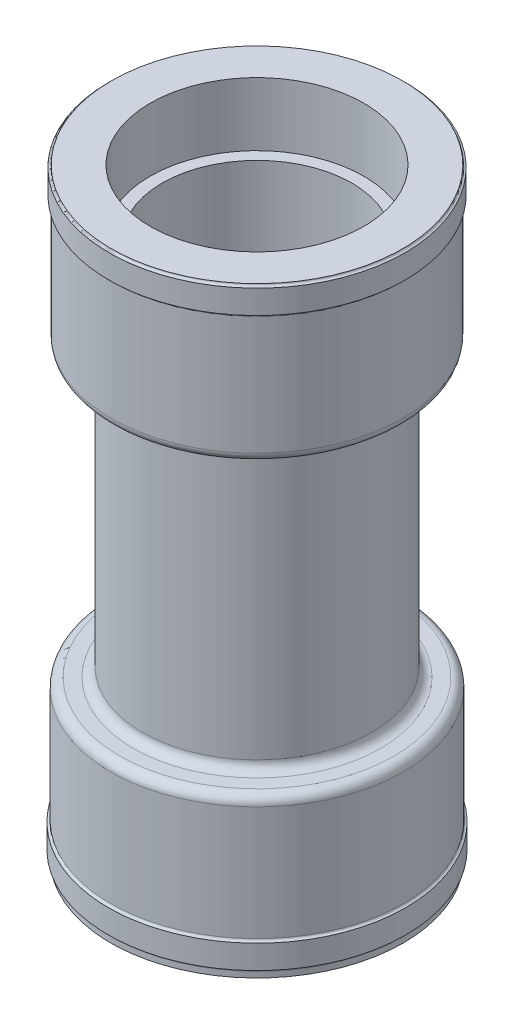
ISO-10303-21;
HEADER;
FILE_DESCRIPTION(('STEP AP214'),'2;1');
FILE_NAME('part.step','',(''),(''),'','','');
FILE_SCHEMA(('AUTOMOTIVE_DESIGN { 1 0 10303 214 1 1 1 1 }'));
ENDSEC;
DATA;
#1=APPLICATION_CONTEXT('core data for automotive mechanical design processes');
#2=APPLICATION_PROTOCOL_DEFINITION('international standard','automotive_design',2000,#1);
#3=PRODUCT_CONTEXT('',#1,'mechanical');
#4=PRODUCT('Part','Part','',(#3));
#5=PRODUCT_RELATED_PRODUCT_CATEGORY('part','',(#4));
#6=PRODUCT_DEFINITION_FORMATION('','',#4);
#7=PRODUCT_DEFINITION_CONTEXT('part definition',#1,'design');
#8=PRODUCT_DEFINITION('design','',#6,#7);
#9=PRODUCT_DEFINITION_SHAPE('','',#8);
#10=(LENGTH_UNIT() NAMED_UNIT(*) SI_UNIT(.MILLI.,.METRE.));
#11=(NAMED_UNIT(*) PLANE_ANGLE_UNIT() SI_UNIT($,.RADIAN.));
#12=(NAMED_UNIT(*) SI_UNIT($,.STERADIAN.) SOLID_ANGLE_UNIT());
#13=UNCERTAINTY_MEASURE_WITH_UNIT(LENGTH_MEASURE(1.E-05),#10,'distance_accuracy_value','');
#14=(GEOMETRIC_REPRESENTATION_CONTEXT(3) GLOBAL_UNCERTAINTY_ASSIGNED_CONTEXT((#13)) GLOBAL_UNIT_ASSIGNED_CONTEXT((#10,
#11,#12)) REPRESENTATION_CONTEXT('',''));
#15=CARTESIAN_POINT('',(0.,0.,0.));
#16=DIRECTION('',(0.,0.,1.));
#17=DIRECTION('',(1.,0.,0.));
#18=AXIS2_PLACEMENT_3D('',#15,#16,#17);
#19=CARTESIAN_POINT('',(0.,-105.537304087526,0.));
#20=DIRECTION('',(0.,-1.,0.));
#21=DIRECTION('',(1.,0.,0.));
#22=AXIS2_PLACEMENT_3D('',#19,#20,#21);
#23=PLANE('',#22);
#24=CARTESIAN_POINT('',(-61.3139252065648,-105.537304087526,0.));
#25=DIRECTION('',(0.,-1.,0.));
#26=DIRECTION('',(1.,0.,0.));
#27=AXIS2_PLACEMENT_3D('',#24,#25,#26);
#28=CIRCLE('',#27,54.);
#29=CARTESIAN_POINT('',(-7.31392520656485,-105.537304087526,0.));
#30=VERTEX_POINT('',#29);
#31=EDGE_CURVE('E62',#30,#30,#28,.T.);
#32=ORIENTED_EDGE('',*,*,#31,.T.);
#33=EDGE_LOOP('',(#32));
#34=FACE_BOUND('',#33,.T.);
#35=CARTESIAN_POINT('',(-61.3139252065648,-105.537304087526,0.));
#36=DIRECTION('',(0.,-1.,0.));
#37=DIRECTION('',(1.,0.,0.));
#38=AXIS2_PLACEMENT_3D('',#35,#36,#37);
#39=CIRCLE('',#38,59.8154522615405);
#40=CARTESIAN_POINT('',(-1.4984729450243,-105.537304087526,0.));
#41=VERTEX_POINT('',#40);
#42=EDGE_CURVE('E66',#41,#41,#39,.F.);
#43=ORIENTED_EDGE('',*,*,#42,.T.);
#44=EDGE_LOOP('',(#43));
#45=FACE_BOUND('',#44,.T.);
#46=ADVANCED_FACE('F38',(#34,#45),#23,.F.);
#47=CARTESIAN_POINT('',(-61.3139252065649,87.9722338350284,0.));
#48=DIRECTION('',(0.,1.,0.));
#49=DIRECTION('',(-1.,0.,0.));
#50=AXIS2_PLACEMENT_3D('',#47,#48,#49);
#51=CYLINDRICAL_SURFACE('',#50,50.);
#52=CARTESIAN_POINT('',(-61.3139252065648,-101.537304087526,0.));
#53=DIRECTION('',(0.,-1.,0.));
#54=DIRECTION('',(1.,0.,0.));
#55=AXIS2_PLACEMENT_3D('',#52,#53,#54);
#56=CIRCLE('',#55,50.);
#57=CARTESIAN_POINT('',(-11.3139252065649,-101.537304087526,0.));
#58=VERTEX_POINT('',#57);
#59=EDGE_CURVE('E70',#58,#58,#56,.F.);
#60=ORIENTED_EDGE('',*,*,#59,.T.);
#61=EDGE_LOOP('',(#60));
#62=FACE_BOUND('',#61,.T.);
#63=CARTESIAN_POINT('',(-61.3139252065648,15.8953921677388,0.));
#64=DIRECTION('',(0.,-1.,0.));
#65=DIRECTION('',(1.,0.,0.));
#66=AXIS2_PLACEMENT_3D('',#63,#64,#65);
#67=CIRCLE('',#66,50.);
#68=CARTESIAN_POINT('',(-11.3139252065649,15.8953921677388,0.));
#69=VERTEX_POINT('',#68);
#70=EDGE_CURVE('E74',#69,#69,#67,.T.);
#71=ORIENTED_EDGE('',*,*,#70,.T.);
#72=EDGE_LOOP('',(#71));
#73=FACE_BOUND('',#72,.T.);
#74=ADVANCED_FACE('F178',(#62,#73),#51,.T.);
#75=CARTESIAN_POINT('',(0.,19.8953921677388,0.));
#76=DIRECTION('',(0.,-1.,0.));
#77=DIRECTION('',(1.,0.,0.));
#78=AXIS2_PLACEMENT_3D('',#75,#76,#77);
#79=PLANE('',#78);
#80=CARTESIAN_POINT('',(-61.3139252065648,19.8953921677388,0.));
#81=DIRECTION('',(0.,-1.,0.));
#82=DIRECTION('',(1.,0.,0.));
#83=AXIS2_PLACEMENT_3D('',#80,#81,#82);
#84=CIRCLE('',#83,54.);
#85=CARTESIAN_POINT('',(-7.31392520656487,19.8953921677388,0.));
#86=VERTEX_POINT('',#85);
#87=EDGE_CURVE('E46',#86,#86,#84,.F.);
#88=ORIENTED_EDGE('',*,*,#87,.T.);
#89=EDGE_LOOP('',(#88));
#90=FACE_BOUND('',#89,.T.);
#91=CARTESIAN_POINT('',(-61.3139252065648,19.8953921677388,0.));
#92=DIRECTION('',(0.,-1.,0.));
#93=DIRECTION('',(1.,0.,0.));
#94=AXIS2_PLACEMENT_3D('',#91,#92,#93);
#95=CIRCLE('',#94,59.5246096301648);
#96=CARTESIAN_POINT('',(-1.78931557640005,19.8953921677388,0.));
#97=VERTEX_POINT('',#96);
#98=EDGE_CURVE('E51',#97,#97,#95,.T.);
#99=ORIENTED_EDGE('',*,*,#98,.T.);
#100=EDGE_LOOP('',(#99));
#101=FACE_BOUND('',#100,.T.);
#102=ADVANCED_FACE('F184',(#90,#101),#79,.T.);
#103=CARTESIAN_POINT('',(-61.3139252065649,87.9722338350284,0.));
#104=DIRECTION('',(0.,1.,0.));
#105=DIRECTION('',(-1.,0.,0.));
#106=AXIS2_PLACEMENT_3D('',#103,#104,#105);
#107=CYLINDRICAL_SURFACE('',#106,63.5246096301648);
#108=CARTESIAN_POINT('',(-61.3139252065648,23.8953921677388,0.));
#109=DIRECTION('',(0.,-1.,0.));
#110=DIRECTION('',(1.,0.,0.));
#111=AXIS2_PLACEMENT_3D('',#108,#109,#110);
#112=CIRCLE('',#111,63.5246096301648);
#113=CARTESIAN_POINT('',(2.21068442359996,23.8953921677388,0.));
#114=VERTEX_POINT('',#113);
#115=EDGE_CURVE('E10',#114,#114,#112,.F.);
#116=ORIENTED_EDGE('',*,*,#115,.T.);
#117=EDGE_LOOP('',(#116));
#118=FACE_BOUND('',#117,.T.);
#119=CARTESIAN_POINT('',(-61.3139252065649,75.6285317828332,0.));
#120=DIRECTION('',(0.,-1.,0.));
#121=DIRECTION('',(1.,0.,0.));
#122=AXIS2_PLACEMENT_3D('',#119,#120,#121);
#123=CIRCLE('',#122,63.5246096301648);
#124=CARTESIAN_POINT('',(2.21068442359995,75.6285317828332,0.));
#125=VERTEX_POINT('',#124);
#126=EDGE_CURVE('E82',#125,#125,#123,.T.);
#127=ORIENTED_EDGE('',*,*,#126,.T.);
#128=EDGE_LOOP('',(#127));
#129=FACE_BOUND('',#128,.T.);
#130=ADVANCED_FACE('F191',(#118,#129),#107,.T.);
#131=CARTESIAN_POINT('',(0.,76.6285317828332,0.));
#132=DIRECTION('',(0.,-1.,0.));
#133=DIRECTION('',(1.,0.,0.));
#134=AXIS2_PLACEMENT_3D('',#131,#132,#133);
#135=PLANE('',#134);
#136=CARTESIAN_POINT('',(-61.3139252065649,76.6285317828332,0.));
#137=DIRECTION('',(0.,-1.,0.));
#138=DIRECTION('',(1.,0.,0.));
#139=AXIS2_PLACEMENT_3D('',#136,#137,#138);
#140=CIRCLE('',#139,64.5246096301648);
#141=CARTESIAN_POINT('',(3.21068442359995,76.6285317828332,0.));
#142=VERTEX_POINT('',#141);
#143=EDGE_CURVE('E86',#142,#142,#140,.F.);
#144=ORIENTED_EDGE('',*,*,#143,.T.);
#145=EDGE_LOOP('',(#144));
#146=FACE_BOUND('',#145,.T.);
#147=CARTESIAN_POINT('',(-61.3139252065649,76.6285317828332,0.));
#148=DIRECTION('',(0.,1.,0.));
#149=DIRECTION('',(-1.,0.,0.));
#150=AXIS2_PLACEMENT_3D('',#147,#148,#149);
#151=CIRCLE('',#150,64.5287115122409);
#152=CARTESIAN_POINT('',(-125.842636718806,76.6285317828332,0.));
#153=VERTEX_POINT('',#152);
#154=EDGE_CURVE('E102',#153,#153,#151,.T.);
#155=ORIENTED_EDGE('',*,*,#154,.F.);
#156=EDGE_LOOP('',(#155));
#157=FACE_BOUND('',#156,.T.);
#158=ADVANCED_FACE('F194',(#146,#157),#135,.T.);
#159=CARTESIAN_POINT('',(-61.3139252065649,87.9722338350284,0.));
#160=DIRECTION('',(0.,1.,0.));
#161=DIRECTION('',(-1.,0.,0.));
#162=AXIS2_PLACEMENT_3D('',#159,#160,#161);
#163=CYLINDRICAL_SURFACE('',#162,64.5287115122409);
#164=ORIENTED_EDGE('',*,*,#154,.T.);
#165=EDGE_LOOP('',(#164));
#166=FACE_BOUND('',#165,.T.);
#167=CARTESIAN_POINT('',(-61.3139252065649,86.9722338350284,0.));
#168=DIRECTION('',(0.,1.,0.));
#169=DIRECTION('',(-1.,0.,0.));
#170=AXIS2_PLACEMENT_3D('',#167,#168,#169);
#171=CIRCLE('',#170,64.5287115122409);
#172=CARTESIAN_POINT('',(-125.842636718806,86.9722338350284,0.));
#173=VERTEX_POINT('',#172);
#174=EDGE_CURVE('E106',#173,#173,#171,.T.);
#175=ORIENTED_EDGE('',*,*,#174,.F.);
#176=EDGE_LOOP('',(#175));
#177=FACE_BOUND('',#176,.T.);
#178=ADVANCED_FACE('F197',(#166,#177),#163,.T.);
#179=CARTESIAN_POINT('',(0.,86.9722338350284,0.));
#180=DIRECTION('',(0.,1.,0.));
#181=DIRECTION('',(-1.,0.,0.));
#182=AXIS2_PLACEMENT_3D('',#179,#180,#181);
#183=PLANE('',#182);
#184=CARTESIAN_POINT('',(-61.3139252065649,86.9722338350284,0.));
#185=DIRECTION('',(0.,1.,0.));
#186=DIRECTION('',(-1.,0.,0.));
#187=AXIS2_PLACEMENT_3D('',#184,#185,#186);
#188=CIRCLE('',#187,64.5085184717571);
#189=CARTESIAN_POINT('',(-125.822443678322,86.9722338350284,0.));
#190=VERTEX_POINT('',#189);
#191=EDGE_CURVE('E78',#190,#190,#188,.F.);
#192=ORIENTED_EDGE('',*,*,#191,.T.);
#193=EDGE_LOOP('',(#192));
#194=FACE_BOUND('',#193,.T.);
#195=ORIENTED_EDGE('',*,*,#174,.T.);
#196=EDGE_LOOP('',(#195));
#197=FACE_BOUND('',#196,.T.);
#198=ADVANCED_FACE('F201',(#194,#197),#183,.T.);
#199=CARTESIAN_POINT('',(0.,87.9722338350284,0.));
#200=DIRECTION('',(0.,1.,0.));
#201=DIRECTION('',(-1.,0.,0.));
#202=AXIS2_PLACEMENT_3D('',#199,#200,#201);
#203=PLANE('',#202);
#204=CARTESIAN_POINT('',(-61.3139252065649,87.9722338350284,0.));
#205=DIRECTION('',(0.,1.,0.));
#206=DIRECTION('',(-1.,0.,0.));
#207=AXIS2_PLACEMENT_3D('',#204,#205,#206);
#208=CIRCLE('',#207,63.5085184717571);
#209=CARTESIAN_POINT('',(-124.822443678322,87.9722338350284,0.));
#210=VERTEX_POINT('',#209);
#211=EDGE_CURVE('E110',#210,#210,#208,.T.);
#212=ORIENTED_EDGE('',*,*,#211,.T.);
#213=EDGE_LOOP('',(#212));
#214=FACE_BOUND('',#213,.T.);
#215=CARTESIAN_POINT('',(-61.3139252065649,87.9722338350284,0.));
#216=DIRECTION('',(0.,1.,0.));
#217=DIRECTION('',(-1.,0.,0.));
#218=AXIS2_PLACEMENT_3D('',#215,#216,#217);
#219=CIRCLE('',#218,46.6);
#220=CARTESIAN_POINT('',(-107.913925206565,87.9722338350284,0.));
#221=VERTEX_POINT('',#220);
#222=EDGE_CURVE('E114',#221,#221,#219,.T.);
#223=ORIENTED_EDGE('',*,*,#222,.F.);
#224=EDGE_LOOP('',(#223));
#225=FACE_BOUND('',#224,.T.);
#226=ADVANCED_FACE('F205',(#214,#225),#203,.T.);
#227=CARTESIAN_POINT('',(-61.3139252065649,87.9722338350284,0.));
#228=DIRECTION('',(0.,1.,0.));
#229=DIRECTION('',(-1.,0.,0.));
#230=AXIS2_PLACEMENT_3D('',#227,#228,#229);
#231=CYLINDRICAL_SURFACE('',#230,46.6);
#232=ORIENTED_EDGE('',*,*,#222,.T.);
#233=EDGE_LOOP('',(#232));
#234=FACE_BOUND('',#233,.T.);
#235=CARTESIAN_POINT('',(-61.3139252065649,60.3722338350283,0.));
#236=DIRECTION('',(0.,1.,0.));
#237=DIRECTION('',(-1.,0.,0.));
#238=AXIS2_PLACEMENT_3D('',#235,#236,#237);
#239=CIRCLE('',#238,46.6);
#240=CARTESIAN_POINT('',(-107.913925206565,60.3722338350283,0.));
#241=VERTEX_POINT('',#240);
#242=EDGE_CURVE('E118',#241,#241,#239,.T.);
#243=ORIENTED_EDGE('',*,*,#242,.F.);
#244=EDGE_LOOP('',(#243));
#245=FACE_BOUND('',#244,.T.);
#246=ADVANCED_FACE('F209',(#234,#245),#231,.F.);
#247=CARTESIAN_POINT('',(0.,60.3722338350284,0.));
#248=DIRECTION('',(0.,1.,0.));
#249=DIRECTION('',(-1.,0.,0.));
#250=AXIS2_PLACEMENT_3D('',#247,#248,#249);
#251=PLANE('',#250);
#252=ORIENTED_EDGE('',*,*,#242,.T.);
#253=EDGE_LOOP('',(#252));
#254=FACE_BOUND('',#253,.T.);
#255=CARTESIAN_POINT('',(-61.3139252065649,60.3722338350283,0.));
#256=DIRECTION('',(0.,1.,0.));
#257=DIRECTION('',(-1.,0.,0.));
#258=AXIS2_PLACEMENT_3D('',#255,#256,#257);
#259=CIRCLE('',#258,41.4);
#260=CARTESIAN_POINT('',(-102.713925206565,60.3722338350283,0.));
#261=VERTEX_POINT('',#260);
#262=EDGE_CURVE('E122',#261,#261,#259,.T.);
#263=ORIENTED_EDGE('',*,*,#262,.F.);
#264=EDGE_LOOP('',(#263));
#265=FACE_BOUND('',#264,.T.);
#266=ADVANCED_FACE('F213',(#254,#265),#251,.T.);
#267=CARTESIAN_POINT('',(-61.3139252065649,87.9722338350284,0.));
#268=DIRECTION('',(0.,1.,0.));
#269=DIRECTION('',(-1.,0.,0.));
#270=AXIS2_PLACEMENT_3D('',#267,#268,#269);
#271=CYLINDRICAL_SURFACE('',#270,41.4);
#272=ORIENTED_EDGE('',*,*,#262,.T.);
#273=EDGE_LOOP('',(#272));
#274=FACE_BOUND('',#273,.T.);
#275=CARTESIAN_POINT('',(-61.3139252065648,-139.6277717328,0.));
#276=DIRECTION('',(0.,1.,0.));
#277=DIRECTION('',(-1.,0.,0.));
#278=AXIS2_PLACEMENT_3D('',#275,#276,#277);
#279=CIRCLE('',#278,41.4);
#280=CARTESIAN_POINT('',(-102.713925206565,-139.6277717328,0.));
#281=VERTEX_POINT('',#280);
#282=EDGE_CURVE('E126',#281,#281,#279,.T.);
#283=ORIENTED_EDGE('',*,*,#282,.F.);
#284=EDGE_LOOP('',(#283));
#285=FACE_BOUND('',#284,.T.);
#286=ADVANCED_FACE('F217',(#274,#285),#271,.F.);
#287=CARTESIAN_POINT('',(0.,-139.6277717328,0.));
#288=DIRECTION('',(0.,1.,0.));
#289=DIRECTION('',(-1.,0.,0.));
#290=AXIS2_PLACEMENT_3D('',#287,#288,#289);
#291=PLANE('',#290);
#292=CARTESIAN_POINT('',(-61.3139252065648,-139.6277717328,0.));
#293=DIRECTION('',(0.,1.,0.));
#294=DIRECTION('',(-1.,0.,0.));
#295=AXIS2_PLACEMENT_3D('',#292,#293,#294);
#296=CIRCLE('',#295,46.5971743800978);
#297=CARTESIAN_POINT('',(-107.911099586663,-139.6277717328,0.));
#298=VERTEX_POINT('',#297);
#299=EDGE_CURVE('E130',#298,#298,#296,.T.);
#300=ORIENTED_EDGE('',*,*,#299,.F.);
#301=EDGE_LOOP('',(#300));
#302=FACE_BOUND('',#301,.T.);
#303=ORIENTED_EDGE('',*,*,#282,.T.);
#304=EDGE_LOOP('',(#303));
#305=FACE_BOUND('',#304,.T.);
#306=ADVANCED_FACE('F221',(#302,#305),#291,.F.);
#307=CARTESIAN_POINT('',(-61.3139252065649,87.9722338350284,0.));
#308=DIRECTION('',(0.,1.,0.));
#309=DIRECTION('',(-1.,0.,0.));
#310=AXIS2_PLACEMENT_3D('',#307,#308,#309);
#311=CYLINDRICAL_SURFACE('',#310,46.5971743800978);
#312=CARTESIAN_POINT('',(-61.3139252065648,-174.174326463567,0.));
#313=DIRECTION('',(0.,1.,0.));
#314=DIRECTION('',(-1.,0.,0.));
#315=AXIS2_PLACEMENT_3D('',#312,#313,#314);
#316=CIRCLE('',#315,46.5971743800978);
#317=CARTESIAN_POINT('',(-107.911099586663,-174.174326463567,0.));
#318=VERTEX_POINT('',#317);
#319=EDGE_CURVE('E134',#318,#318,#316,.T.);
#320=ORIENTED_EDGE('',*,*,#319,.F.);
#321=EDGE_LOOP('',(#320));
#322=FACE_BOUND('',#321,.T.);
#323=ORIENTED_EDGE('',*,*,#299,.T.);
#324=EDGE_LOOP('',(#323));
#325=FACE_BOUND('',#324,.T.);
#326=ADVANCED_FACE('F225',(#322,#325),#311,.F.);
#327=CARTESIAN_POINT('',(0.,-174.174326463567,0.));
#328=DIRECTION('',(0.,1.,0.));
#329=DIRECTION('',(-1.,0.,0.));
#330=AXIS2_PLACEMENT_3D('',#327,#328,#329);
#331=PLANE('',#330);
#332=CARTESIAN_POINT('',(-61.3139252065648,-174.174326463567,0.));
#333=DIRECTION('',(0.,1.,0.));
#334=DIRECTION('',(-1.,0.,0.));
#335=AXIS2_PLACEMENT_3D('',#332,#333,#334);
#336=CIRCLE('',#335,63.8241057894739);
#337=CARTESIAN_POINT('',(-125.138030996039,-174.174326463567,0.));
#338=VERTEX_POINT('',#337);
#339=EDGE_CURVE('E138',#338,#338,#336,.T.);
#340=ORIENTED_EDGE('',*,*,#339,.F.);
#341=EDGE_LOOP('',(#340));
#342=FACE_BOUND('',#341,.T.);
#343=ORIENTED_EDGE('',*,*,#319,.T.);
#344=EDGE_LOOP('',(#343));
#345=FACE_BOUND('',#344,.T.);
#346=ADVANCED_FACE('F229',(#342,#345),#331,.F.);
#347=CARTESIAN_POINT('',(-61.3139252065649,87.9722338350284,0.));
#348=DIRECTION('',(0.,1.,0.));
#349=DIRECTION('',(-1.,0.,0.));
#350=AXIS2_PLACEMENT_3D('',#347,#348,#349);
#351=CYLINDRICAL_SURFACE('',#350,63.8241057894739);
#352=CARTESIAN_POINT('',(-61.3139252065648,-171.671498813625,0.));
#353=DIRECTION('',(0.,1.,0.));
#354=DIRECTION('',(-1.,0.,0.));
#355=AXIS2_PLACEMENT_3D('',#352,#353,#354);
#356=CIRCLE('',#355,63.8241057894739);
#357=CARTESIAN_POINT('',(-125.138030996039,-171.671498813625,0.));
#358=VERTEX_POINT('',#357);
#359=EDGE_CURVE('E90',#358,#358,#356,.F.);
#360=ORIENTED_EDGE('',*,*,#359,.T.);
#361=EDGE_LOOP('',(#360));
#362=FACE_BOUND('',#361,.T.);
#363=ORIENTED_EDGE('',*,*,#339,.T.);
#364=EDGE_LOOP('',(#363));
#365=FACE_BOUND('',#364,.T.);
#366=ADVANCED_FACE('F156',(#362,#365),#351,.T.);
#367=CARTESIAN_POINT('',(-61.3139252065649,87.9722338350284,0.));
#368=DIRECTION('',(0.,1.,0.));
#369=DIRECTION('',(-1.,0.,0.));
#370=AXIS2_PLACEMENT_3D('',#367,#368,#369);
#371=CYLINDRICAL_SURFACE('',#370,64.8198825707748);
#372=CARTESIAN_POINT('',(-61.3139252065648,-160.321084419236,0.));
#373=DIRECTION('',(0.,1.,0.));
#374=DIRECTION('',(-1.,0.,0.));
#375=AXIS2_PLACEMENT_3D('',#372,#373,#374);
#376=CIRCLE('',#375,64.8198825707748);
#377=CARTESIAN_POINT('',(-126.13380777734,-160.321084419236,0.));
#378=VERTEX_POINT('',#377);
#379=EDGE_CURVE('E146',#378,#378,#376,.T.);
#380=ORIENTED_EDGE('',*,*,#379,.F.);
#381=EDGE_LOOP('',(#380));
#382=FACE_BOUND('',#381,.T.);
#383=CARTESIAN_POINT('',(-61.3139252065648,-170.671507731452,0.));
#384=DIRECTION('',(0.,1.,0.));
#385=DIRECTION('',(-1.,0.,0.));
#386=AXIS2_PLACEMENT_3D('',#383,#384,#385);
#387=CIRCLE('',#386,64.8198825707748);
#388=CARTESIAN_POINT('',(-126.13380777734,-170.671507731452,0.));
#389=VERTEX_POINT('',#388);
#390=EDGE_CURVE('E142',#389,#389,#387,.T.);
#391=ORIENTED_EDGE('',*,*,#390,.T.);
#392=EDGE_LOOP('',(#391));
#393=FACE_BOUND('',#392,.T.);
#394=ADVANCED_FACE('F153',(#382,#393),#371,.T.);
#395=CARTESIAN_POINT('',(0.,-160.321084419236,0.));
#396=DIRECTION('',(0.,-1.,0.));
#397=DIRECTION('',(1.,0.,0.));
#398=AXIS2_PLACEMENT_3D('',#395,#396,#397);
#399=PLANE('',#398);
#400=CARTESIAN_POINT('',(-61.3139252065648,-160.321084419236,0.));
#401=DIRECTION('',(0.,-1.,0.));
#402=DIRECTION('',(1.,0.,0.));
#403=AXIS2_PLACEMENT_3D('',#400,#401,#402);
#404=CIRCLE('',#403,64.8154522615405);
#405=CARTESIAN_POINT('',(3.50152705497571,-160.321084419236,0.));
#406=VERTEX_POINT('',#405);
#407=EDGE_CURVE('E94',#406,#406,#404,.T.);
#408=ORIENTED_EDGE('',*,*,#407,.T.);
#409=EDGE_LOOP('',(#408));
#410=FACE_BOUND('',#409,.T.);
#411=ORIENTED_EDGE('',*,*,#379,.T.);
#412=EDGE_LOOP('',(#411));
#413=FACE_BOUND('',#412,.T.);
#414=ADVANCED_FACE('F151',(#410,#413),#399,.F.);
#415=CARTESIAN_POINT('',(-61.3139252065649,87.9722338350284,0.));
#416=DIRECTION('',(0.,1.,0.));
#417=DIRECTION('',(-1.,0.,0.));
#418=AXIS2_PLACEMENT_3D('',#415,#416,#417);
#419=CYLINDRICAL_SURFACE('',#418,63.8154522615405);
#420=CARTESIAN_POINT('',(-61.3139252065648,-109.537304087526,0.));
#421=DIRECTION('',(0.,-1.,0.));
#422=DIRECTION('',(1.,0.,0.));
#423=AXIS2_PLACEMENT_3D('',#420,#421,#422);
#424=CIRCLE('',#423,63.8154522615405);
#425=CARTESIAN_POINT('',(2.5015270549757,-109.537304087526,0.));
#426=VERTEX_POINT('',#425);
#427=EDGE_CURVE('E56',#426,#426,#424,.T.);
#428=ORIENTED_EDGE('',*,*,#427,.T.);
#429=EDGE_LOOP('',(#428));
#430=FACE_BOUND('',#429,.T.);
#431=CARTESIAN_POINT('',(-61.3139252065648,-159.321084419236,0.));
#432=DIRECTION('',(0.,-1.,0.));
#433=DIRECTION('',(1.,0.,0.));
#434=AXIS2_PLACEMENT_3D('',#431,#432,#433);
#435=CIRCLE('',#434,63.8154522615405);
#436=CARTESIAN_POINT('',(2.50152705497571,-159.321084419236,0.));
#437=VERTEX_POINT('',#436);
#438=EDGE_CURVE('E98',#437,#437,#435,.F.);
#439=ORIENTED_EDGE('',*,*,#438,.T.);
#440=EDGE_LOOP('',(#439));
#441=FACE_BOUND('',#440,.T.);
#442=ADVANCED_FACE('F173',(#430,#441),#419,.T.);
#443=CARTESIAN_POINT('',(-61.3139252065648,-159.321084419236,0.));
#444=DIRECTION('',(0.,-1.,0.));
#445=DIRECTION('',(1.,0.,0.));
#446=AXIS2_PLACEMENT_3D('',#443,#444,#445);
#447=TOROIDAL_SURFACE('',#446,64.8154522615405,1.);
#448=ORIENTED_EDGE('',*,*,#407,.F.);
#449=EDGE_LOOP('',(#448));
#450=FACE_BOUND('',#449,.T.);
#451=ORIENTED_EDGE('',*,*,#438,.F.);
#452=EDGE_LOOP('',(#451));
#453=FACE_BOUND('',#452,.T.);
#454=ADVANCED_FACE('F163',(#450,#453),#447,.F.);
#455=CARTESIAN_POINT('',(-61.3139252065648,-171.671498813625,0.));
#456=DIRECTION('',(0.,1.,0.));
#457=DIRECTION('',(-1.,0.,0.));
#458=AXIS2_PLACEMENT_3D('',#455,#456,#457);
#459=TOROIDAL_SURFACE('',#458,64.8241057894739,1.);
#460=ORIENTED_EDGE('',*,*,#359,.F.);
#461=EDGE_LOOP('',(#460));
#462=FACE_BOUND('',#461,.T.);
#463=ORIENTED_EDGE('',*,*,#390,.F.);
#464=EDGE_LOOP('',(#463));
#465=FACE_BOUND('',#464,.T.);
#466=ADVANCED_FACE('F160',(#462,#465),#459,.F.);
#467=CARTESIAN_POINT('',(-61.3139252065649,75.6285317828332,0.));
#468=DIRECTION('',(0.,-1.,0.));
#469=DIRECTION('',(1.,0.,0.));
#470=AXIS2_PLACEMENT_3D('',#467,#468,#469);
#471=TOROIDAL_SURFACE('',#470,64.5246096301648,1.);
#472=ORIENTED_EDGE('',*,*,#126,.F.);
#473=EDGE_LOOP('',(#472));
#474=FACE_BOUND('',#473,.T.);
#475=ORIENTED_EDGE('',*,*,#143,.F.);
#476=EDGE_LOOP('',(#475));
#477=FACE_BOUND('',#476,.T.);
#478=ADVANCED_FACE('F162',(#474,#477),#471,.F.);
#479=CARTESIAN_POINT('',(-61.3139252065649,87.9722338350284,0.));
#480=DIRECTION('',(0.,1.,0.));
#481=DIRECTION('',(-1.,0.,0.));
#482=AXIS2_PLACEMENT_3D('',#479,#480,#481);
#483=TOROIDAL_SURFACE('',#482,64.5085184717571,1.);
#484=ORIENTED_EDGE('',*,*,#191,.F.);
#485=EDGE_LOOP('',(#484));
#486=FACE_BOUND('',#485,.T.);
#487=ORIENTED_EDGE('',*,*,#211,.F.);
#488=EDGE_LOOP('',(#487));
#489=FACE_BOUND('',#488,.T.);
#490=ADVANCED_FACE('F170',(#486,#489),#483,.F.);
#491=CARTESIAN_POINT('',(-61.3139252065648,-101.537304087526,0.));
#492=DIRECTION('',(0.,-1.,0.));
#493=DIRECTION('',(1.,0.,0.));
#494=AXIS2_PLACEMENT_3D('',#491,#492,#493);
#495=TOROIDAL_SURFACE('',#494,54.,4.);
#496=ORIENTED_EDGE('',*,*,#31,.F.);
#497=EDGE_LOOP('',(#496));
#498=FACE_BOUND('',#497,.T.);
#499=ORIENTED_EDGE('',*,*,#59,.F.);
#500=EDGE_LOOP('',(#499));
#501=FACE_BOUND('',#500,.T.);
#502=ADVANCED_FACE('F253',(#498,#501),#495,.F.);
#503=CARTESIAN_POINT('',(-61.3139252065648,-109.537304087526,0.));
#504=DIRECTION('',(0.,-1.,0.));
#505=DIRECTION('',(1.,0.,0.));
#506=AXIS2_PLACEMENT_3D('',#503,#504,#505);
#507=TOROIDAL_SURFACE('',#506,59.8154522615405,4.);
#508=ORIENTED_EDGE('',*,*,#427,.F.);
#509=EDGE_LOOP('',(#508));
#510=FACE_BOUND('',#509,.T.);
#511=ORIENTED_EDGE('',*,*,#42,.F.);
#512=EDGE_LOOP('',(#511));
#513=FACE_BOUND('',#512,.T.);
#514=ADVANCED_FACE('F249',(#510,#513),#507,.T.);
#515=CARTESIAN_POINT('',(-61.3139252065648,15.8953921677388,0.));
#516=DIRECTION('',(0.,-1.,0.));
#517=DIRECTION('',(1.,0.,0.));
#518=AXIS2_PLACEMENT_3D('',#515,#516,#517);
#519=TOROIDAL_SURFACE('',#518,54.,4.);
#520=ORIENTED_EDGE('',*,*,#70,.F.);
#521=EDGE_LOOP('',(#520));
#522=FACE_BOUND('',#521,.T.);
#523=ORIENTED_EDGE('',*,*,#87,.F.);
#524=EDGE_LOOP('',(#523));
#525=FACE_BOUND('',#524,.T.);
#526=ADVANCED_FACE('F252',(#522,#525),#519,.F.);
#527=CARTESIAN_POINT('',(-61.3139252065648,23.8953921677388,0.));
#528=DIRECTION('',(0.,-1.,0.));
#529=DIRECTION('',(1.,0.,0.));
#530=AXIS2_PLACEMENT_3D('',#527,#528,#529);
#531=TOROIDAL_SURFACE('',#530,59.5246096301648,4.);
#532=ORIENTED_EDGE('',*,*,#98,.F.);
#533=EDGE_LOOP('',(#532));
#534=FACE_BOUND('',#533,.T.);
#535=ORIENTED_EDGE('',*,*,#115,.F.);
#536=EDGE_LOOP('',(#535));
#537=FACE_BOUND('',#536,.T.);
#538=ADVANCED_FACE('F40',(#534,#537),#531,.T.);
#539=CLOSED_SHELL('',(#46,#74,#102,#130,#158,#178,#198,#226,#246,#266,#286,#306,#326,#346,#366,
#394,#414,#442,#454,#466,#478,#490,#502,#514,#526,#538));
#540=MANIFOLD_SOLID_BREP('B2',#539);
#541=ADVANCED_BREP_SHAPE_REPRESENTATION('',(#18,#540),#14);
#542=SHAPE_DEFINITION_REPRESENTATION(#9,#541);
ENDSEC;
END-ISO-10303-21;
